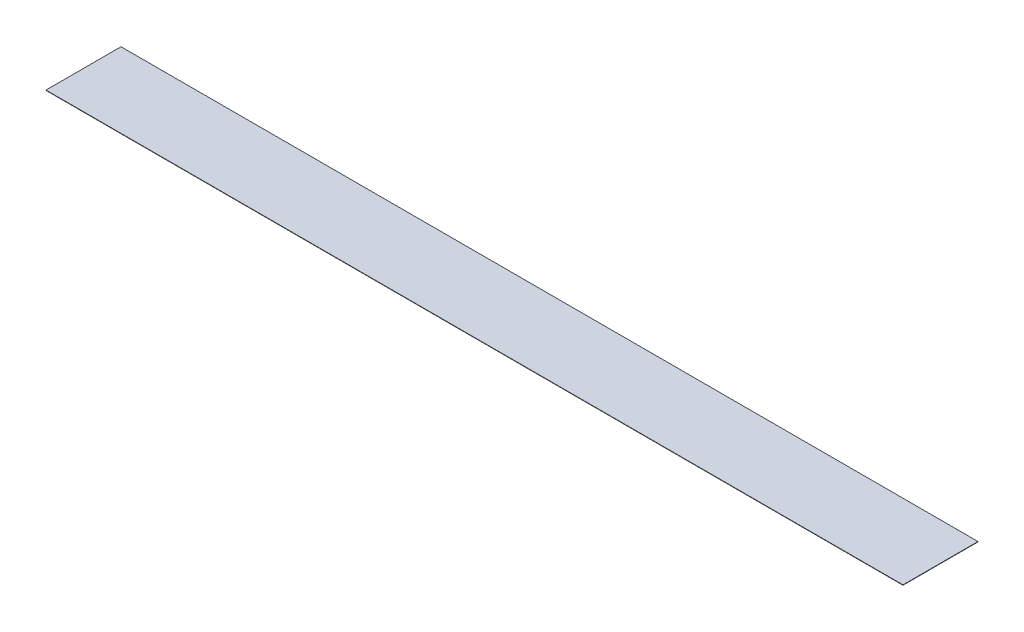
ISO-10303-21;
HEADER;
FILE_DESCRIPTION(('STEP AP214'),'2;1');
FILE_NAME('part.step','',(''),(''),'','','');
FILE_SCHEMA(('AUTOMOTIVE_DESIGN { 1 0 10303 214 1 1 1 1 }'));
ENDSEC;
DATA;
#1=APPLICATION_CONTEXT('core data for automotive mechanical design processes');
#2=APPLICATION_PROTOCOL_DEFINITION('international standard','automotive_design',2000,#1);
#3=PRODUCT_CONTEXT('',#1,'mechanical');
#4=PRODUCT('Part','Part','',(#3));
#5=PRODUCT_RELATED_PRODUCT_CATEGORY('part','',(#4));
#6=PRODUCT_DEFINITION_FORMATION('','',#4);
#7=PRODUCT_DEFINITION_CONTEXT('part definition',#1,'design');
#8=PRODUCT_DEFINITION('design','',#6,#7);
#9=PRODUCT_DEFINITION_SHAPE('','',#8);
#10=(LENGTH_UNIT() NAMED_UNIT(*) SI_UNIT(.MILLI.,.METRE.));
#11=(NAMED_UNIT(*) PLANE_ANGLE_UNIT() SI_UNIT($,.RADIAN.));
#12=(NAMED_UNIT(*) SI_UNIT($,.STERADIAN.) SOLID_ANGLE_UNIT());
#13=UNCERTAINTY_MEASURE_WITH_UNIT(LENGTH_MEASURE(1.E-05),#10,'distance_accuracy_value','');
#14=(GEOMETRIC_REPRESENTATION_CONTEXT(3) GLOBAL_UNCERTAINTY_ASSIGNED_CONTEXT((#13)) GLOBAL_UNIT_ASSIGNED_CONTEXT((#10,
#11,#12)) REPRESENTATION_CONTEXT('',''));
#15=CARTESIAN_POINT('',(0.,0.,0.));
#16=DIRECTION('',(0.,0.,1.));
#17=DIRECTION('',(1.,0.,0.));
#18=AXIS2_PLACEMENT_3D('',#15,#16,#17);
#19=CARTESIAN_POINT('',(0.,0.,0.));
#20=DIRECTION('',(0.,-1.,0.));
#21=DIRECTION('',(0.,0.,-1.));
#22=AXIS2_PLACEMENT_3D('',#19,#20,#21);
#23=PLANE('',#22);
#24=DIRECTION('',(0.,0.,-1.));
#25=VECTOR('',#24,1.);
#26=CARTESIAN_POINT('',(-290.195,0.,25.4));
#27=LINE('',#26,#25);
#28=CARTESIAN_POINT('',(-290.195,0.,25.4));
#29=VERTEX_POINT('',#28);
#30=CARTESIAN_POINT('',(-290.195,0.,-25.4));
#31=VERTEX_POINT('',#30);
#32=EDGE_CURVE('E55',#29,#31,#27,.T.);
#33=ORIENTED_EDGE('',*,*,#32,.T.);
#34=DIRECTION('',(1.,0.,0.));
#35=VECTOR('',#34,1.);
#36=CARTESIAN_POINT('',(-290.195,0.,-25.4));
#37=LINE('',#36,#35);
#38=CARTESIAN_POINT('',(290.195,0.,-25.4));
#39=VERTEX_POINT('',#38);
#40=EDGE_CURVE('E76',#31,#39,#37,.T.);
#41=ORIENTED_EDGE('',*,*,#40,.T.);
#42=DIRECTION('',(0.,0.,1.));
#43=VECTOR('',#42,1.);
#44=CARTESIAN_POINT('',(290.195,0.,25.4));
#45=LINE('',#44,#43);
#46=CARTESIAN_POINT('',(290.195,0.,25.4));
#47=VERTEX_POINT('',#46);
#48=EDGE_CURVE('E58',#39,#47,#45,.T.);
#49=ORIENTED_EDGE('',*,*,#48,.T.);
#50=DIRECTION('',(-1.,0.,0.));
#51=VECTOR('',#50,1.);
#52=CARTESIAN_POINT('',(-290.195,0.,25.4));
#53=LINE('',#52,#51);
#54=EDGE_CURVE('E20',#47,#29,#53,.T.);
#55=ORIENTED_EDGE('',*,*,#54,.T.);
#56=EDGE_LOOP('',(#33,#41,#49,#55));
#57=FACE_BOUND('',#56,.T.);
#58=ADVANCED_FACE('F17',(#57),#23,.T.);
#59=CARTESIAN_POINT('',(-290.195,0.254,25.4));
#60=DIRECTION('',(0.,0.,-1.));
#61=DIRECTION('',(-1.,0.,0.));
#62=AXIS2_PLACEMENT_3D('',#59,#60,#61);
#63=PLANE('',#62);
#64=DIRECTION('',(0.,1.,0.));
#65=VECTOR('',#64,1.);
#66=CARTESIAN_POINT('',(290.195,0.254,25.4));
#67=LINE('',#66,#65);
#68=CARTESIAN_POINT('',(290.195,0.254,25.4));
#69=VERTEX_POINT('',#68);
#70=EDGE_CURVE('E78',#47,#69,#67,.T.);
#71=ORIENTED_EDGE('',*,*,#70,.T.);
#72=DIRECTION('',(1.,0.,0.));
#73=VECTOR('',#72,1.);
#74=CARTESIAN_POINT('',(0.,0.254,25.4));
#75=LINE('',#74,#73);
#76=CARTESIAN_POINT('',(-290.195,0.254,25.4));
#77=VERTEX_POINT('',#76);
#78=EDGE_CURVE('E73',#69,#77,#75,.F.);
#79=ORIENTED_EDGE('',*,*,#78,.T.);
#80=DIRECTION('',(0.,1.,0.));
#81=VECTOR('',#80,1.);
#82=CARTESIAN_POINT('',(-290.195,0.254,25.4));
#83=LINE('',#82,#81);
#84=EDGE_CURVE('E63',#77,#29,#83,.F.);
#85=ORIENTED_EDGE('',*,*,#84,.T.);
#86=ORIENTED_EDGE('',*,*,#54,.F.);
#87=EDGE_LOOP('',(#71,#79,#85,#86));
#88=FACE_BOUND('',#87,.T.);
#89=ADVANCED_FACE('F72',(#88),#63,.F.);
#90=CARTESIAN_POINT('',(-290.195,0.254,25.4));
#91=DIRECTION('',(1.,0.,0.));
#92=DIRECTION('',(0.,0.,-1.));
#93=AXIS2_PLACEMENT_3D('',#90,#91,#92);
#94=PLANE('',#93);
#95=ORIENTED_EDGE('',*,*,#84,.F.);
#96=DIRECTION('',(0.,0.,-1.));
#97=VECTOR('',#96,1.);
#98=CARTESIAN_POINT('',(-290.195,0.254,0.));
#99=LINE('',#98,#97);
#100=CARTESIAN_POINT('',(-290.195,0.254,-25.4));
#101=VERTEX_POINT('',#100);
#102=EDGE_CURVE('E83',#77,#101,#99,.T.);
#103=ORIENTED_EDGE('',*,*,#102,.T.);
#104=DIRECTION('',(0.,1.,0.));
#105=VECTOR('',#104,1.);
#106=CARTESIAN_POINT('',(-290.195,0.254,-25.4));
#107=LINE('',#106,#105);
#108=EDGE_CURVE('E69',#101,#31,#107,.F.);
#109=ORIENTED_EDGE('',*,*,#108,.T.);
#110=ORIENTED_EDGE('',*,*,#32,.F.);
#111=EDGE_LOOP('',(#95,#103,#109,#110));
#112=FACE_BOUND('',#111,.T.);
#113=ADVANCED_FACE('F66',(#112),#94,.F.);
#114=CARTESIAN_POINT('',(-290.195,0.254,-25.4));
#115=DIRECTION('',(0.,0.,1.));
#116=DIRECTION('',(1.,0.,0.));
#117=AXIS2_PLACEMENT_3D('',#114,#115,#116);
#118=PLANE('',#117);
#119=ORIENTED_EDGE('',*,*,#108,.F.);
#120=DIRECTION('',(1.,0.,0.));
#121=VECTOR('',#120,1.);
#122=CARTESIAN_POINT('',(0.,0.254,-25.4));
#123=LINE('',#122,#121);
#124=CARTESIAN_POINT('',(290.195,0.254,-25.4));
#125=VERTEX_POINT('',#124);
#126=EDGE_CURVE('E26',#101,#125,#123,.T.);
#127=ORIENTED_EDGE('',*,*,#126,.T.);
#128=DIRECTION('',(0.,1.,0.));
#129=VECTOR('',#128,1.);
#130=CARTESIAN_POINT('',(290.195,0.254,-25.4));
#131=LINE('',#130,#129);
#132=EDGE_CURVE('E34',#125,#39,#131,.F.);
#133=ORIENTED_EDGE('',*,*,#132,.T.);
#134=ORIENTED_EDGE('',*,*,#40,.F.);
#135=EDGE_LOOP('',(#119,#127,#133,#134));
#136=FACE_BOUND('',#135,.T.);
#137=ADVANCED_FACE('F88',(#136),#118,.F.);
#138=CARTESIAN_POINT('',(290.195,0.254,25.4));
#139=DIRECTION('',(-1.,0.,0.));
#140=DIRECTION('',(0.,0.,1.));
#141=AXIS2_PLACEMENT_3D('',#138,#139,#140);
#142=PLANE('',#141);
#143=ORIENTED_EDGE('',*,*,#132,.F.);
#144=DIRECTION('',(0.,0.,-1.));
#145=VECTOR('',#144,1.);
#146=CARTESIAN_POINT('',(290.195,0.254,0.));
#147=LINE('',#146,#145);
#148=EDGE_CURVE('E11',#125,#69,#147,.F.);
#149=ORIENTED_EDGE('',*,*,#148,.T.);
#150=ORIENTED_EDGE('',*,*,#70,.F.);
#151=ORIENTED_EDGE('',*,*,#48,.F.);
#152=EDGE_LOOP('',(#143,#149,#150,#151));
#153=FACE_BOUND('',#152,.T.);
#154=ADVANCED_FACE('F91',(#153),#142,.F.);
#155=CARTESIAN_POINT('',(0.,0.254,0.));
#156=DIRECTION('',(0.,-1.,0.));
#157=DIRECTION('',(0.,0.,-1.));
#158=AXIS2_PLACEMENT_3D('',#155,#156,#157);
#159=PLANE('',#158);
#160=ORIENTED_EDGE('',*,*,#126,.F.);
#161=ORIENTED_EDGE('',*,*,#102,.F.);
#162=ORIENTED_EDGE('',*,*,#78,.F.);
#163=ORIENTED_EDGE('',*,*,#148,.F.);
#164=EDGE_LOOP('',(#160,#161,#162,#163));
#165=FACE_BOUND('',#164,.T.);
#166=ADVANCED_FACE('F90',(#165),#159,.F.);
#167=CLOSED_SHELL('',(#58,#89,#113,#137,#154,#166));
#168=MANIFOLD_SOLID_BREP('B1',#167);
#169=ADVANCED_BREP_SHAPE_REPRESENTATION('',(#18,#168),#14);
#170=SHAPE_DEFINITION_REPRESENTATION(#9,#169);
ENDSEC;
END-ISO-10303-21;
